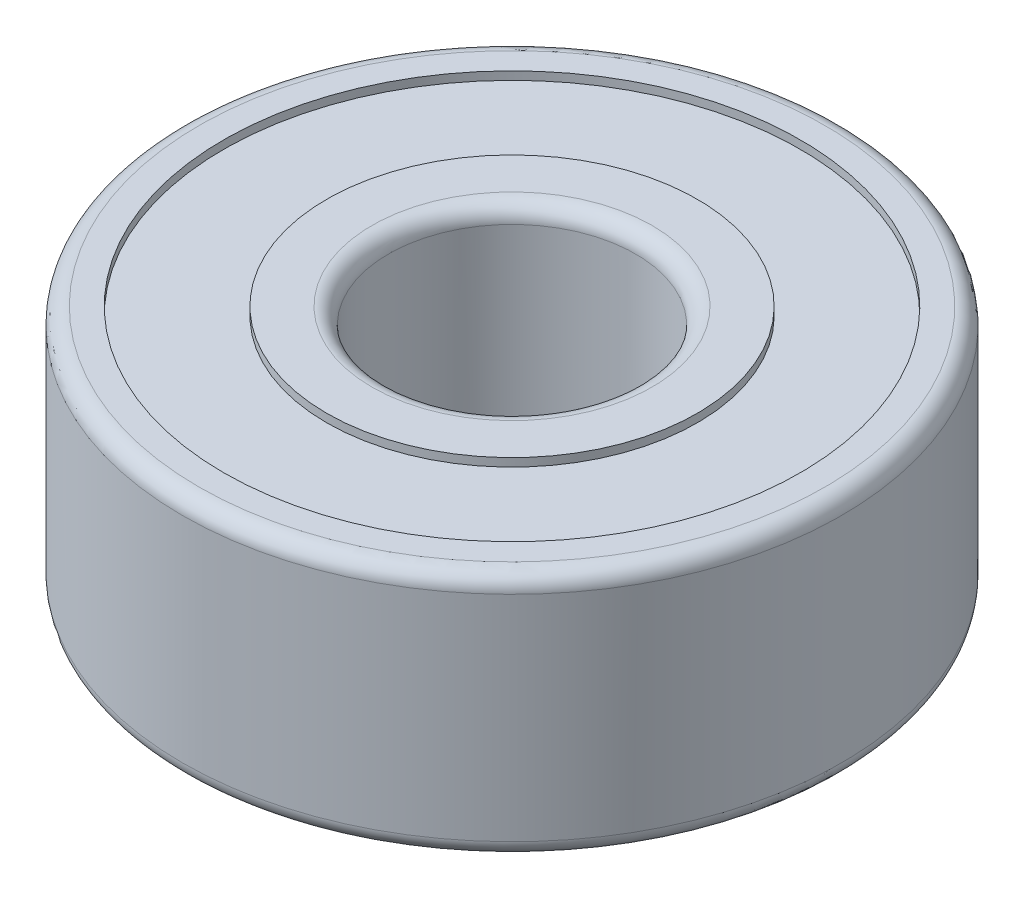
ISO-10303-21;
HEADER;
FILE_DESCRIPTION(('STEP AP214'),'2;1');
FILE_NAME('part.step','',(''),(''),'','','');
FILE_SCHEMA(('AUTOMOTIVE_DESIGN { 1 0 10303 214 1 1 1 1 }'));
ENDSEC;
DATA;
#1=APPLICATION_CONTEXT('core data for automotive mechanical design processes');
#2=APPLICATION_PROTOCOL_DEFINITION('international standard','automotive_design',2000,#1);
#3=PRODUCT_CONTEXT('',#1,'mechanical');
#4=PRODUCT('Part','Part','',(#3));
#5=PRODUCT_RELATED_PRODUCT_CATEGORY('part','',(#4));
#6=PRODUCT_DEFINITION_FORMATION('','',#4);
#7=PRODUCT_DEFINITION_CONTEXT('part definition',#1,'design');
#8=PRODUCT_DEFINITION('design','',#6,#7);
#9=PRODUCT_DEFINITION_SHAPE('','',#8);
#10=(LENGTH_UNIT() NAMED_UNIT(*) SI_UNIT(.MILLI.,.METRE.));
#11=(NAMED_UNIT(*) PLANE_ANGLE_UNIT() SI_UNIT($,.RADIAN.));
#12=(NAMED_UNIT(*) SI_UNIT($,.STERADIAN.) SOLID_ANGLE_UNIT());
#13=UNCERTAINTY_MEASURE_WITH_UNIT(LENGTH_MEASURE(1.E-05),#10,'distance_accuracy_value','');
#14=(GEOMETRIC_REPRESENTATION_CONTEXT(3) GLOBAL_UNCERTAINTY_ASSIGNED_CONTEXT((#13)) GLOBAL_UNIT_ASSIGNED_CONTEXT((#10,
#11,#12)) REPRESENTATION_CONTEXT('',''));
#15=CARTESIAN_POINT('',(0.,0.,0.));
#16=DIRECTION('',(0.,0.,1.));
#17=DIRECTION('',(1.,0.,0.));
#18=AXIS2_PLACEMENT_3D('',#15,#16,#17);
#19=CARTESIAN_POINT('',(0.,17.3076923076923,0.));
#20=DIRECTION('',(0.,1.,0.));
#21=DIRECTION('',(0.,0.,1.));
#22=AXIS2_PLACEMENT_3D('',#19,#20,#21);
#23=CYLINDRICAL_SURFACE('',#22,4.);
#24=CARTESIAN_POINT('',(0.,-1.3,0.));
#25=DIRECTION('',(0.,-1.,0.));
#26=DIRECTION('',(0.,0.,-1.));
#27=AXIS2_PLACEMENT_3D('',#24,#25,#26);
#28=CIRCLE('',#27,4.);
#29=CARTESIAN_POINT('',(0.,-1.3,-4.));
#30=VERTEX_POINT('',#29);
#31=EDGE_CURVE('E50',#30,#30,#28,.F.);
#32=ORIENTED_EDGE('',*,*,#31,.T.);
#33=EDGE_LOOP('',(#32));
#34=FACE_BOUND('',#33,.T.);
#35=CARTESIAN_POINT('',(0.,1.3,0.));
#36=DIRECTION('',(0.,1.,0.));
#37=DIRECTION('',(0.,0.,1.));
#38=AXIS2_PLACEMENT_3D('',#35,#36,#37);
#39=CIRCLE('',#38,4.);
#40=CARTESIAN_POINT('',(0.,1.3,4.));
#41=VERTEX_POINT('',#40);
#42=EDGE_CURVE('E66',#41,#41,#39,.F.);
#43=ORIENTED_EDGE('',*,*,#42,.T.);
#44=EDGE_LOOP('',(#43));
#45=FACE_BOUND('',#44,.T.);
#46=ADVANCED_FACE('F42',(#34,#45),#23,.T.);
#47=CARTESIAN_POINT('',(0.,1.5,4.));
#48=DIRECTION('',(0.,1.,0.));
#49=DIRECTION('',(0.,0.,1.));
#50=AXIS2_PLACEMENT_3D('',#47,#48,#49);
#51=PLANE('',#50);
#52=CARTESIAN_POINT('',(0.,1.5,0.));
#53=DIRECTION('',(0.,1.,0.));
#54=DIRECTION('',(0.,0.,1.));
#55=AXIS2_PLACEMENT_3D('',#52,#53,#54);
#56=CIRCLE('',#55,3.8);
#57=CARTESIAN_POINT('',(0.,1.5,3.8));
#58=VERTEX_POINT('',#57);
#59=EDGE_CURVE('E70',#58,#58,#56,.T.);
#60=ORIENTED_EDGE('',*,*,#59,.T.);
#61=EDGE_LOOP('',(#60));
#62=FACE_BOUND('',#61,.T.);
#63=CARTESIAN_POINT('',(0.,1.5,0.));
#64=DIRECTION('',(0.,1.,0.));
#65=DIRECTION('',(0.,0.,1.));
#66=AXIS2_PLACEMENT_3D('',#63,#64,#65);
#67=CIRCLE('',#66,3.5);
#68=CARTESIAN_POINT('',(0.,1.5,3.5));
#69=VERTEX_POINT('',#68);
#70=EDGE_CURVE('E82',#69,#69,#67,.T.);
#71=ORIENTED_EDGE('',*,*,#70,.F.);
#72=EDGE_LOOP('',(#71));
#73=FACE_BOUND('',#72,.T.);
#74=ADVANCED_FACE('F131',(#62,#73),#51,.T.);
#75=CARTESIAN_POINT('',(0.,17.3076923076923,0.));
#76=DIRECTION('',(0.,1.,0.));
#77=DIRECTION('',(0.,0.,1.));
#78=AXIS2_PLACEMENT_3D('',#75,#76,#77);
#79=CYLINDRICAL_SURFACE('',#78,3.5);
#80=ORIENTED_EDGE('',*,*,#70,.T.);
#81=EDGE_LOOP('',(#80));
#82=FACE_BOUND('',#81,.T.);
#83=CARTESIAN_POINT('',(0.,1.4,0.));
#84=DIRECTION('',(0.,1.,0.));
#85=DIRECTION('',(0.,0.,1.));
#86=AXIS2_PLACEMENT_3D('',#83,#84,#85);
#87=CIRCLE('',#86,3.5);
#88=CARTESIAN_POINT('',(0.,1.4,3.5));
#89=VERTEX_POINT('',#88);
#90=EDGE_CURVE('E86',#89,#89,#87,.T.);
#91=ORIENTED_EDGE('',*,*,#90,.F.);
#92=EDGE_LOOP('',(#91));
#93=FACE_BOUND('',#92,.T.);
#94=ADVANCED_FACE('F136',(#82,#93),#79,.F.);
#95=CARTESIAN_POINT('',(0.,1.4,3.5));
#96=DIRECTION('',(0.,1.,0.));
#97=DIRECTION('',(0.,0.,1.));
#98=AXIS2_PLACEMENT_3D('',#95,#96,#97);
#99=PLANE('',#98);
#100=ORIENTED_EDGE('',*,*,#90,.T.);
#101=EDGE_LOOP('',(#100));
#102=FACE_BOUND('',#101,.T.);
#103=CARTESIAN_POINT('',(0.,1.4,0.));
#104=DIRECTION('',(0.,1.,0.));
#105=DIRECTION('',(0.,0.,1.));
#106=AXIS2_PLACEMENT_3D('',#103,#104,#105);
#107=CIRCLE('',#106,2.25);
#108=CARTESIAN_POINT('',(0.,1.4,2.25));
#109=VERTEX_POINT('',#108);
#110=EDGE_CURVE('E90',#109,#109,#107,.T.);
#111=ORIENTED_EDGE('',*,*,#110,.F.);
#112=EDGE_LOOP('',(#111));
#113=FACE_BOUND('',#112,.T.);
#114=ADVANCED_FACE('F164',(#102,#113),#99,.T.);
#115=CARTESIAN_POINT('',(0.,17.3076923076923,0.));
#116=DIRECTION('',(0.,1.,0.));
#117=DIRECTION('',(0.,0.,1.));
#118=AXIS2_PLACEMENT_3D('',#115,#116,#117);
#119=CYLINDRICAL_SURFACE('',#118,2.25);
#120=ORIENTED_EDGE('',*,*,#110,.T.);
#121=EDGE_LOOP('',(#120));
#122=FACE_BOUND('',#121,.T.);
#123=CARTESIAN_POINT('',(0.,1.5,0.));
#124=DIRECTION('',(0.,1.,0.));
#125=DIRECTION('',(0.,0.,1.));
#126=AXIS2_PLACEMENT_3D('',#123,#124,#125);
#127=CIRCLE('',#126,2.25);
#128=CARTESIAN_POINT('',(0.,1.5,2.25));
#129=VERTEX_POINT('',#128);
#130=EDGE_CURVE('E94',#129,#129,#127,.T.);
#131=ORIENTED_EDGE('',*,*,#130,.F.);
#132=EDGE_LOOP('',(#131));
#133=FACE_BOUND('',#132,.T.);
#134=ADVANCED_FACE('F169',(#122,#133),#119,.T.);
#135=CARTESIAN_POINT('',(0.,1.5,2.25));
#136=DIRECTION('',(0.,1.,0.));
#137=DIRECTION('',(0.,0.,1.));
#138=AXIS2_PLACEMENT_3D('',#135,#136,#137);
#139=PLANE('',#138);
#140=CARTESIAN_POINT('',(0.,1.5,0.));
#141=DIRECTION('',(0.,1.,0.));
#142=DIRECTION('',(0.,0.,1.));
#143=AXIS2_PLACEMENT_3D('',#140,#141,#142);
#144=CIRCLE('',#143,1.7);
#145=CARTESIAN_POINT('',(0.,1.5,1.7));
#146=VERTEX_POINT('',#145);
#147=EDGE_CURVE('E74',#146,#146,#144,.F.);
#148=ORIENTED_EDGE('',*,*,#147,.T.);
#149=EDGE_LOOP('',(#148));
#150=FACE_BOUND('',#149,.T.);
#151=ORIENTED_EDGE('',*,*,#130,.T.);
#152=EDGE_LOOP('',(#151));
#153=FACE_BOUND('',#152,.T.);
#154=ADVANCED_FACE('F175',(#150,#153),#139,.T.);
#155=CARTESIAN_POINT('',(0.,17.3076923076923,0.));
#156=DIRECTION('',(0.,1.,0.));
#157=DIRECTION('',(0.,0.,1.));
#158=AXIS2_PLACEMENT_3D('',#155,#156,#157);
#159=CYLINDRICAL_SURFACE('',#158,1.5);
#160=CARTESIAN_POINT('',(0.,-1.3,0.));
#161=DIRECTION('',(0.,-1.,0.));
#162=DIRECTION('',(0.,0.,-1.));
#163=AXIS2_PLACEMENT_3D('',#160,#161,#162);
#164=CIRCLE('',#163,1.5);
#165=CARTESIAN_POINT('',(0.,-1.3,-1.5));
#166=VERTEX_POINT('',#165);
#167=EDGE_CURVE('E55',#166,#166,#164,.T.);
#168=ORIENTED_EDGE('',*,*,#167,.T.);
#169=EDGE_LOOP('',(#168));
#170=FACE_BOUND('',#169,.T.);
#171=CARTESIAN_POINT('',(0.,1.3,0.));
#172=DIRECTION('',(0.,1.,0.));
#173=DIRECTION('',(0.,0.,1.));
#174=AXIS2_PLACEMENT_3D('',#171,#172,#173);
#175=CIRCLE('',#174,1.5);
#176=CARTESIAN_POINT('',(0.,1.3,1.5));
#177=VERTEX_POINT('',#176);
#178=EDGE_CURVE('E78',#177,#177,#175,.T.);
#179=ORIENTED_EDGE('',*,*,#178,.T.);
#180=EDGE_LOOP('',(#179));
#181=FACE_BOUND('',#180,.T.);
#182=ADVANCED_FACE('F146',(#170,#181),#159,.F.);
#183=CARTESIAN_POINT('',(0.,1.3,0.));
#184=DIRECTION('',(0.,1.,0.));
#185=DIRECTION('',(0.,0.,1.));
#186=AXIS2_PLACEMENT_3D('',#183,#184,#185);
#187=TOROIDAL_SURFACE('',#186,1.7,0.2);
#188=ORIENTED_EDGE('',*,*,#147,.F.);
#189=EDGE_LOOP('',(#188));
#190=FACE_BOUND('',#189,.T.);
#191=ORIENTED_EDGE('',*,*,#178,.F.);
#192=EDGE_LOOP('',(#191));
#193=FACE_BOUND('',#192,.T.);
#194=ADVANCED_FACE('F142',(#190,#193),#187,.T.);
#195=CARTESIAN_POINT('',(0.,1.3,0.));
#196=DIRECTION('',(0.,1.,0.));
#197=DIRECTION('',(0.,0.,1.));
#198=AXIS2_PLACEMENT_3D('',#195,#196,#197);
#199=TOROIDAL_SURFACE('',#198,3.8,0.2);
#200=ORIENTED_EDGE('',*,*,#42,.F.);
#201=EDGE_LOOP('',(#200));
#202=FACE_BOUND('',#201,.T.);
#203=ORIENTED_EDGE('',*,*,#59,.F.);
#204=EDGE_LOOP('',(#203));
#205=FACE_BOUND('',#204,.T.);
#206=ADVANCED_FACE('F145',(#202,#205),#199,.T.);
#207=CARTESIAN_POINT('',(0.,-1.5,4.));
#208=DIRECTION('',(0.,-1.,0.));
#209=DIRECTION('',(0.,0.,1.));
#210=AXIS2_PLACEMENT_3D('',#207,#208,#209);
#211=PLANE('',#210);
#212=CARTESIAN_POINT('',(0.,-1.5,0.));
#213=DIRECTION('',(0.,-1.,0.));
#214=DIRECTION('',(0.,0.,-1.));
#215=AXIS2_PLACEMENT_3D('',#212,#213,#214);
#216=CIRCLE('',#215,3.8);
#217=CARTESIAN_POINT('',(0.,-1.5,-3.8));
#218=VERTEX_POINT('',#217);
#219=EDGE_CURVE('E10',#218,#218,#216,.T.);
#220=ORIENTED_EDGE('',*,*,#219,.T.);
#221=EDGE_LOOP('',(#220));
#222=FACE_BOUND('',#221,.T.);
#223=CARTESIAN_POINT('',(0.,-1.5,0.));
#224=DIRECTION('',(0.,1.,0.));
#225=DIRECTION('',(0.,0.,1.));
#226=AXIS2_PLACEMENT_3D('',#223,#224,#225);
#227=CIRCLE('',#226,3.5);
#228=CARTESIAN_POINT('',(0.,-1.5,3.5));
#229=VERTEX_POINT('',#228);
#230=EDGE_CURVE('E98',#229,#229,#227,.T.);
#231=ORIENTED_EDGE('',*,*,#230,.T.);
#232=EDGE_LOOP('',(#231));
#233=FACE_BOUND('',#232,.T.);
#234=ADVANCED_FACE('F149',(#222,#233),#211,.T.);
#235=CARTESIAN_POINT('',(0.,-17.3076923076923,0.));
#236=DIRECTION('',(0.,-1.,0.));
#237=DIRECTION('',(0.,0.,1.));
#238=AXIS2_PLACEMENT_3D('',#235,#236,#237);
#239=CYLINDRICAL_SURFACE('',#238,3.5);
#240=ORIENTED_EDGE('',*,*,#230,.F.);
#241=EDGE_LOOP('',(#240));
#242=FACE_BOUND('',#241,.T.);
#243=CARTESIAN_POINT('',(0.,-1.4,0.));
#244=DIRECTION('',(0.,1.,0.));
#245=DIRECTION('',(0.,0.,1.));
#246=AXIS2_PLACEMENT_3D('',#243,#244,#245);
#247=CIRCLE('',#246,3.5);
#248=CARTESIAN_POINT('',(0.,-1.4,3.5));
#249=VERTEX_POINT('',#248);
#250=EDGE_CURVE('E102',#249,#249,#247,.T.);
#251=ORIENTED_EDGE('',*,*,#250,.T.);
#252=EDGE_LOOP('',(#251));
#253=FACE_BOUND('',#252,.T.);
#254=ADVANCED_FACE('F154',(#242,#253),#239,.F.);
#255=CARTESIAN_POINT('',(0.,-1.4,3.5));
#256=DIRECTION('',(0.,-1.,0.));
#257=DIRECTION('',(0.,0.,1.));
#258=AXIS2_PLACEMENT_3D('',#255,#256,#257);
#259=PLANE('',#258);
#260=ORIENTED_EDGE('',*,*,#250,.F.);
#261=EDGE_LOOP('',(#260));
#262=FACE_BOUND('',#261,.T.);
#263=CARTESIAN_POINT('',(0.,-1.4,0.));
#264=DIRECTION('',(0.,1.,0.));
#265=DIRECTION('',(0.,0.,1.));
#266=AXIS2_PLACEMENT_3D('',#263,#264,#265);
#267=CIRCLE('',#266,2.25);
#268=CARTESIAN_POINT('',(0.,-1.4,2.25));
#269=VERTEX_POINT('',#268);
#270=EDGE_CURVE('E106',#269,#269,#267,.T.);
#271=ORIENTED_EDGE('',*,*,#270,.T.);
#272=EDGE_LOOP('',(#271));
#273=FACE_BOUND('',#272,.T.);
#274=ADVANCED_FACE('F127',(#262,#273),#259,.T.);
#275=CARTESIAN_POINT('',(0.,-17.3076923076923,0.));
#276=DIRECTION('',(0.,-1.,0.));
#277=DIRECTION('',(0.,0.,1.));
#278=AXIS2_PLACEMENT_3D('',#275,#276,#277);
#279=CYLINDRICAL_SURFACE('',#278,2.25);
#280=ORIENTED_EDGE('',*,*,#270,.F.);
#281=EDGE_LOOP('',(#280));
#282=FACE_BOUND('',#281,.T.);
#283=CARTESIAN_POINT('',(0.,-1.5,0.));
#284=DIRECTION('',(0.,1.,0.));
#285=DIRECTION('',(0.,0.,1.));
#286=AXIS2_PLACEMENT_3D('',#283,#284,#285);
#287=CIRCLE('',#286,2.25);
#288=CARTESIAN_POINT('',(0.,-1.5,2.25));
#289=VERTEX_POINT('',#288);
#290=EDGE_CURVE('E110',#289,#289,#287,.T.);
#291=ORIENTED_EDGE('',*,*,#290,.T.);
#292=EDGE_LOOP('',(#291));
#293=FACE_BOUND('',#292,.T.);
#294=ADVANCED_FACE('F115',(#282,#293),#279,.T.);
#295=CARTESIAN_POINT('',(0.,-1.5,2.25));
#296=DIRECTION('',(0.,-1.,0.));
#297=DIRECTION('',(0.,0.,1.));
#298=AXIS2_PLACEMENT_3D('',#295,#296,#297);
#299=PLANE('',#298);
#300=CARTESIAN_POINT('',(0.,-1.5,0.));
#301=DIRECTION('',(0.,-1.,0.));
#302=DIRECTION('',(0.,0.,-1.));
#303=AXIS2_PLACEMENT_3D('',#300,#301,#302);
#304=CIRCLE('',#303,1.7);
#305=CARTESIAN_POINT('',(0.,-1.5,-1.7));
#306=VERTEX_POINT('',#305);
#307=EDGE_CURVE('E60',#306,#306,#304,.F.);
#308=ORIENTED_EDGE('',*,*,#307,.T.);
#309=EDGE_LOOP('',(#308));
#310=FACE_BOUND('',#309,.T.);
#311=ORIENTED_EDGE('',*,*,#290,.F.);
#312=EDGE_LOOP('',(#311));
#313=FACE_BOUND('',#312,.T.);
#314=ADVANCED_FACE('F117',(#310,#313),#299,.T.);
#315=CARTESIAN_POINT('',(0.,-1.3,0.));
#316=DIRECTION('',(0.,-1.,0.));
#317=DIRECTION('',(0.,0.,-1.));
#318=AXIS2_PLACEMENT_3D('',#315,#316,#317);
#319=TOROIDAL_SURFACE('',#318,1.7,0.2);
#320=ORIENTED_EDGE('',*,*,#167,.F.);
#321=EDGE_LOOP('',(#320));
#322=FACE_BOUND('',#321,.T.);
#323=ORIENTED_EDGE('',*,*,#307,.F.);
#324=EDGE_LOOP('',(#323));
#325=FACE_BOUND('',#324,.T.);
#326=ADVANCED_FACE('F119',(#322,#325),#319,.T.);
#327=CARTESIAN_POINT('',(0.,-1.3,0.));
#328=DIRECTION('',(0.,-1.,0.));
#329=DIRECTION('',(0.,0.,-1.));
#330=AXIS2_PLACEMENT_3D('',#327,#328,#329);
#331=TOROIDAL_SURFACE('',#330,3.8,0.2);
#332=ORIENTED_EDGE('',*,*,#219,.F.);
#333=EDGE_LOOP('',(#332));
#334=FACE_BOUND('',#333,.T.);
#335=ORIENTED_EDGE('',*,*,#31,.F.);
#336=EDGE_LOOP('',(#335));
#337=FACE_BOUND('',#336,.T.);
#338=ADVANCED_FACE('F44',(#334,#337),#331,.T.);
#339=CLOSED_SHELL('',(#46,#74,#94,#114,#134,#154,#182,#194,#206,#234,#254,#274,#294,#314,#326,#338));
#340=MANIFOLD_SOLID_BREP('B2',#339);
#341=ADVANCED_BREP_SHAPE_REPRESENTATION('',(#18,#340),#14);
#342=SHAPE_DEFINITION_REPRESENTATION(#9,#341);
ENDSEC;
END-ISO-10303-21;
